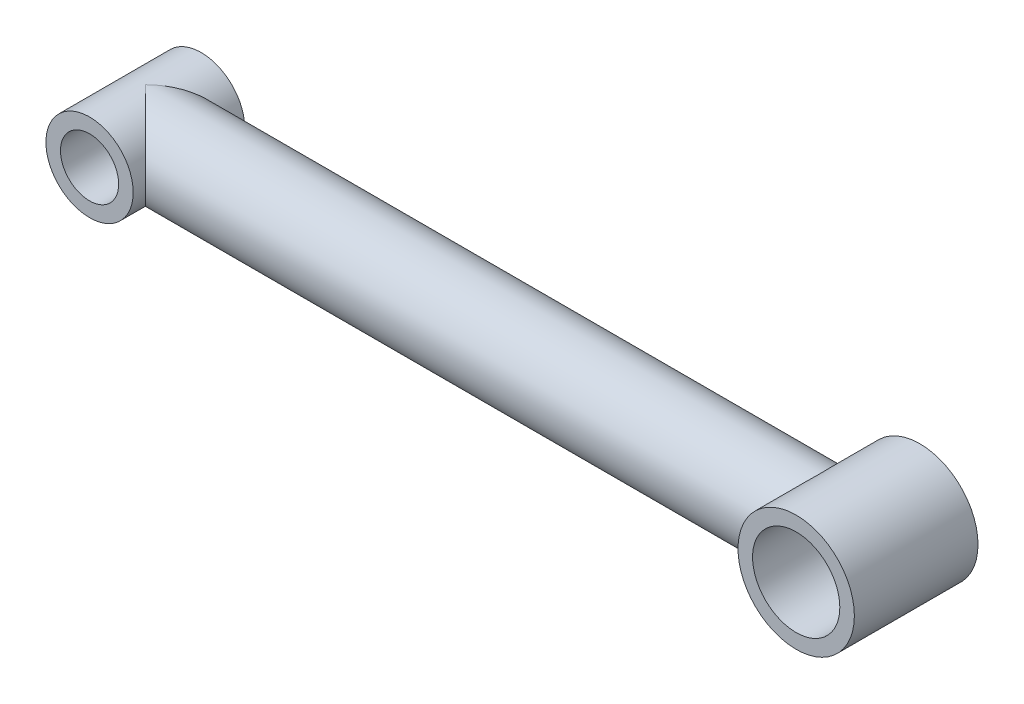
ISO-10303-21;
HEADER;
FILE_DESCRIPTION(('STEP AP214'),'2;1');
FILE_NAME('part.step','',(''),(''),'','','');
FILE_SCHEMA(('AUTOMOTIVE_DESIGN { 1 0 10303 214 1 1 1 1 }'));
ENDSEC;
DATA;
#1=APPLICATION_CONTEXT('core data for automotive mechanical design processes');
#2=APPLICATION_PROTOCOL_DEFINITION('international standard','automotive_design',2000,#1);
#3=PRODUCT_CONTEXT('',#1,'mechanical');
#4=PRODUCT('Part','Part','',(#3));
#5=PRODUCT_RELATED_PRODUCT_CATEGORY('part','',(#4));
#6=PRODUCT_DEFINITION_FORMATION('','',#4);
#7=PRODUCT_DEFINITION_CONTEXT('part definition',#1,'design');
#8=PRODUCT_DEFINITION('design','',#6,#7);
#9=PRODUCT_DEFINITION_SHAPE('','',#8);
#10=(LENGTH_UNIT() NAMED_UNIT(*) SI_UNIT(.MILLI.,.METRE.));
#11=(NAMED_UNIT(*) PLANE_ANGLE_UNIT() SI_UNIT($,.RADIAN.));
#12=(NAMED_UNIT(*) SI_UNIT($,.STERADIAN.) SOLID_ANGLE_UNIT());
#13=UNCERTAINTY_MEASURE_WITH_UNIT(LENGTH_MEASURE(1.E-05),#10,'distance_accuracy_value','');
#14=(GEOMETRIC_REPRESENTATION_CONTEXT(3) GLOBAL_UNCERTAINTY_ASSIGNED_CONTEXT((#13)) GLOBAL_UNIT_ASSIGNED_CONTEXT((#10,
#11,#12)) REPRESENTATION_CONTEXT('',''));
#15=CARTESIAN_POINT('',(0.,0.,0.));
#16=DIRECTION('',(0.,0.,1.));
#17=DIRECTION('',(1.,0.,0.));
#18=AXIS2_PLACEMENT_3D('',#15,#16,#17);
#19=CARTESIAN_POINT('',(-39.51605,0.,0.));
#20=DIRECTION('',(1.,0.,0.));
#21=DIRECTION('',(0.,0.,-1.));
#22=AXIS2_PLACEMENT_3D('',#19,#20,#21);
#23=CYLINDRICAL_SURFACE('',#22,4.8387);
#24=CARTESIAN_POINT('',(33.06445,0.,-4.8387));
#25=CARTESIAN_POINT('',(33.0644511276449,0.118159996354448,-4.83869883155296));
#26=CARTESIAN_POINT('',(33.0677040470359,0.236349582229863,-4.83436390761329));
#27=CARTESIAN_POINT('',(33.0806425925981,0.471795603460159,-4.81709200170503));
#28=CARTESIAN_POINT('',(33.0903320678769,0.589051437938931,-4.80414987255953));
#29=CARTESIAN_POINT('',(33.1159390660575,0.821864655067225,-4.76984545864021));
#30=CARTESIAN_POINT('',(33.1318684564224,0.93741836340248,-4.74846712879409));
#31=CARTESIAN_POINT('',(33.1695970631896,1.16579726358989,-4.69761961613336));
#32=CARTESIAN_POINT('',(33.1913988995626,1.27862121302515,-4.66814682188734));
#33=CARTESIAN_POINT('',(33.2402407572106,1.50004213084022,-4.60175616533791));
#34=CARTESIAN_POINT('',(33.2672453575193,1.60866203273255,-4.56488858149733));
#35=CARTESIAN_POINT('',(33.3260527709962,1.82190326437486,-4.48405016924305));
#36=CARTESIAN_POINT('',(33.357857482271,1.92652299173378,-4.44007653039531));
#37=CARTESIAN_POINT('',(33.4595663516177,2.23349488988543,-4.29828310211814));
#38=CARTESIAN_POINT('',(33.5358311668364,2.42924815891171,-4.19050268829808));
#39=CARTESIAN_POINT('',(33.708015918149,2.81765908109961,-3.94106999342351));
#40=CARTESIAN_POINT('',(33.8051019884369,3.00835138293002,-3.7972053120827));
#41=CARTESIAN_POINT('',(34.0074615553383,3.36460490579047,-3.4854795680493));
#42=CARTESIAN_POINT('',(34.1127475758339,3.53012649818328,-3.31758145764898));
#43=CARTESIAN_POINT('',(34.2823149933385,3.77407784746668,-3.03138797060837));
#44=CARTESIAN_POINT('',(34.3462392295664,3.86095162995898,-2.91994501296414));
#45=CARTESIAN_POINT('',(34.4728843618073,4.02496512794902,-2.68936756979823));
#46=CARTESIAN_POINT('',(34.5356048901483,4.10210190818255,-2.5702307812186));
#47=CARTESIAN_POINT('',(34.6578375009837,4.24615459856921,-2.32453010105055));
#48=CARTESIAN_POINT('',(34.7173527513096,4.31308072464255,-2.197973810679));
#49=CARTESIAN_POINT('',(34.8309303857712,4.43619284285151,-1.93751682307982));
#50=CARTESIAN_POINT('',(34.8849958659324,4.49238494943314,-1.80362036333452));
#51=CARTESIAN_POINT('',(35.0006657616257,4.60902870517622,-1.48551086922291));
#52=CARTESIAN_POINT('',(35.0593666607427,4.66534793469925,-1.29862384274409));
#53=CARTESIAN_POINT('',(35.1316542159518,4.7330018055299,-1.01066267290408));
#54=CARTESIAN_POINT('',(35.1531150810258,4.75274251773177,-0.913460955899135));
#55=CARTESIAN_POINT('',(35.1899870574242,4.78632905185485,-0.716932973596778));
#56=CARTESIAN_POINT('',(35.2054012860945,4.80017791163521,-0.617607830958811));
#57=CARTESIAN_POINT('',(35.2296102673995,4.82180943860323,-0.416525184578084));
#58=CARTESIAN_POINT('',(35.2383409797483,4.82953344307788,-0.314753556219373));
#59=CARTESIAN_POINT('',(35.2485036079525,4.83851600821196,-0.110558761392505));
#60=CARTESIAN_POINT('',(35.2499357240758,4.83977474627331,-0.00813561287877199));
#61=CARTESIAN_POINT('',(35.2454222766859,4.83579274504726,0.196455765710037));
#62=CARTESIAN_POINT('',(35.2394742985726,4.83054987858202,0.298623901389884));
#63=CARTESIAN_POINT('',(35.2205145043996,4.81369606795549,0.501745315341448));
#64=CARTESIAN_POINT('',(35.2075026163712,4.80208505891409,0.602698581225081));
#65=CARTESIAN_POINT('',(35.162245833115,4.76120745183617,0.881127068975693));
#66=CARTESIAN_POINT('',(35.1229204735532,4.72523582699486,1.05651761222448));
#67=CARTESIAN_POINT('',(35.0285085852756,4.63565375404839,1.39823639586973));
#68=CARTESIAN_POINT('',(34.9734069141928,4.5820263521854,1.56455574611924));
#69=CARTESIAN_POINT('',(34.8638066913072,4.47042576454663,1.85687983808639));
#70=CARTESIAN_POINT('',(34.8111151825605,4.41513196729847,1.98461506258768));
#71=CARTESIAN_POINT('',(34.7009489076965,4.29471800382679,2.23327353835713));
#72=CARTESIAN_POINT('',(34.6434716952956,4.22959279813144,2.35419325215968));
#73=CARTESIAN_POINT('',(34.5256223186308,4.08988333951575,2.58932650941927));
#74=CARTESIAN_POINT('',(34.465244392451,4.01527973129272,2.70352561051764));
#75=CARTESIAN_POINT('',(34.3434055101773,3.85705399818053,2.92483404502835));
#76=CARTESIAN_POINT('',(34.2819447251488,3.7734332872758,3.03194448578475));
#77=CARTESIAN_POINT('',(34.1578656967867,3.59514720754391,3.24149981437565));
#78=CARTESIAN_POINT('',(34.0952571190906,3.5002573105847,3.34376013216635));
#79=CARTESIAN_POINT('',(33.9718884854361,3.30138553322304,3.54025943509215));
#80=CARTESIAN_POINT('',(33.9111291703743,3.19740007172284,3.63449523173977));
#81=CARTESIAN_POINT('',(33.7339484449427,2.87246217217889,3.90396839041659));
#82=CARTESIAN_POINT('',(33.6222391886917,2.63799680769806,4.06660007238562));
#83=CARTESIAN_POINT('',(33.44250073536,2.18671053366304,4.32253940065243));
#84=CARTESIAN_POINT('',(33.3702044822965,1.97578128335415,4.42320888615188));
#85=CARTESIAN_POINT('',(33.2770022054627,1.64635976621913,4.55153200521708));
#86=CARTESIAN_POINT('',(33.2484696958296,1.53435050492367,4.59053338154447));
#87=CARTESIAN_POINT('',(33.1970673175814,1.30660047015606,4.66047025763526));
#88=CARTESIAN_POINT('',(33.1741950111743,1.19086132746604,4.69140923009969));
#89=CARTESIAN_POINT('',(33.1344965821523,0.955635674346972,4.74493656739224));
#90=CARTESIAN_POINT('',(33.117710533235,0.836129764303931,4.76746961219771));
#91=CARTESIAN_POINT('',(33.0908021968206,0.59501654901773,4.80352255109813));
#92=CARTESIAN_POINT('',(33.0806799255498,0.473409238658431,4.81704242324615));
#93=CARTESIAN_POINT('',(33.067362553609,0.229180292953863,4.83481950679172));
#94=CARTESIAN_POINT('',(33.0641651429242,0.106559009558504,4.83907980702541));
#95=CARTESIAN_POINT('',(33.0647747076991,-0.138627680293078,4.83826705874601));
#96=CARTESIAN_POINT('',(33.0685811312224,-0.261193090391049,4.83319474568841));
#97=CARTESIAN_POINT('',(33.0823648060857,-0.492857590820958,4.81479110535683));
#98=CARTESIAN_POINT('',(33.0916806613027,-0.60206760610043,4.80234476239973));
#99=CARTESIAN_POINT('',(33.1156917656603,-0.818823991891436,4.77017516914637));
#100=CARTESIAN_POINT('',(33.1303888038885,-0.926369796692505,4.75044949866708));
#101=CARTESIAN_POINT('',(33.1821418059372,-1.24539656535844,4.68073390737616));
#102=CARTESIAN_POINT('',(33.2268712023224,-1.45344963748207,4.62019033146451));
#103=CARTESIAN_POINT('',(33.3354244368606,-1.86266439171962,4.47131800712237));
#104=CARTESIAN_POINT('',(33.3998664553339,-2.06332371281715,4.38208405689383));
#105=CARTESIAN_POINT('',(33.5429339910701,-2.44682113538857,4.18008063536524));
#106=CARTESIAN_POINT('',(33.6215614702782,-2.62965676633063,4.06730790815384));
#107=CARTESIAN_POINT('',(33.8025356563985,-3.00486829701742,3.80069513896698));
#108=CARTESIAN_POINT('',(33.9066506315876,-3.19373829884343,3.64314197270175));
#109=CARTESIAN_POINT('',(34.1212763291417,-3.54426927199526,3.30317541582856));
#110=CARTESIAN_POINT('',(34.2318008931127,-3.70586816976867,3.12070697592009));
#111=CARTESIAN_POINT('',(34.4066417801167,-3.94069404492267,2.81156780143479));
#112=CARTESIAN_POINT('',(34.4715637984172,-4.02322515953912,2.69218557494149));
#113=CARTESIAN_POINT('',(34.59884035061,-4.17782270118707,2.44540965583469));
#114=CARTESIAN_POINT('',(34.6611939351762,-4.24988528334407,2.31801304419834));
#115=CARTESIAN_POINT('',(34.7808419187282,-4.38279911588072,2.05563886364125));
#116=CARTESIAN_POINT('',(34.8381480398632,-4.44367671973697,1.92068011831904));
#117=CARTESIAN_POINT('',(34.9450634119596,-4.55358013314293,1.64322782885859));
#118=CARTESIAN_POINT('',(34.9946790317499,-4.60261576851204,1.50074065189375));
#119=CARTESIAN_POINT('',(35.0928605353592,-4.69725589684139,1.17611323927315));
#120=CARTESIAN_POINT('',(35.1387663235761,-4.73970188420541,0.99217379816162));
#121=CARTESIAN_POINT('',(35.1909251002347,-4.78716754813924,0.710717180417086));
#122=CARTESIAN_POINT('',(35.2055246382197,-4.80028614958089,0.616026650785432));
#123=CARTESIAN_POINT('',(35.2286168899883,-4.82092377247148,0.42531402883707));
#124=CARTESIAN_POINT('',(35.2371123231249,-4.82844528745214,0.329292548910585));
#125=CARTESIAN_POINT('',(35.2476437825593,-4.83775782419048,0.136098108374618));
#126=CARTESIAN_POINT('',(35.2496447975381,-4.83951778593314,0.0389217318341516));
#127=CARTESIAN_POINT('',(35.2469976431341,-4.83718281416198,-0.155267149256333));
#128=CARTESIAN_POINT('',(35.2423496134872,-4.83308800369164,-0.252279657207304));
#129=CARTESIAN_POINT('',(35.2266131434734,-4.81912680919505,-0.445445199963966));
#130=CARTESIAN_POINT('',(35.2155187686437,-4.80925510694057,-0.541597359809289));
#131=CARTESIAN_POINT('',(35.1873663480799,-4.78393105538028,-0.732313948684754));
#132=CARTESIAN_POINT('',(35.1703052159348,-4.76847581775499,-0.826877529411902));
#133=CARTESIAN_POINT('',(35.126594320172,-4.72830663510214,-1.0342034662092));
#134=CARTESIAN_POINT('',(35.098665858096,-4.70230973537356,-1.14644775298811));
#135=CARTESIAN_POINT('',(35.0363121851416,-4.64294527052892,-1.36717108375954));
#136=CARTESIAN_POINT('',(35.0018820738743,-4.60957214258576,-1.47564721414504));
#137=CARTESIAN_POINT('',(34.927844431187,-4.53588394226251,-1.68863845803999));
#138=CARTESIAN_POINT('',(34.888226681287,-4.49555511764852,-1.79314521442501));
#139=CARTESIAN_POINT('',(34.8051581513187,-4.40843102708008,-1.99777835309904));
#140=CARTESIAN_POINT('',(34.7617085406141,-4.36163773142679,-2.09790605787972));
#141=CARTESIAN_POINT('',(34.6565272846475,-4.24456481511026,-2.3277925008318));
#142=CARTESIAN_POINT('',(34.5936859763403,-4.17177165087356,-2.45576861085215));
#143=CARTESIAN_POINT('',(34.4654226977657,-4.01553647003125,-2.70369420017864));
#144=CARTESIAN_POINT('',(34.3999999278143,-3.93209113542169,-2.82364116069386));
#145=CARTESIAN_POINT('',(34.2685206330475,-3.75483227108062,-3.05541312626949));
#146=CARTESIAN_POINT('',(34.2024636678837,-3.66101097708268,-3.16723194397669));
#147=CARTESIAN_POINT('',(34.0715278879066,-3.46329059876146,-3.38230222399991));
#148=CARTESIAN_POINT('',(34.0066489310449,-3.35939273921751,-3.48555472470502));
#149=CARTESIAN_POINT('',(33.8791425335592,-3.14079013524473,-3.68380332411019));
#150=CARTESIAN_POINT('',(33.8165386060585,-3.02600188293851,-3.77872271618356));
#151=CARTESIAN_POINT('',(33.6957506090928,-2.78661626394552,-3.95855981951722));
#152=CARTESIAN_POINT('',(33.6375671178712,-2.66201761827398,-4.04347622306993));
#153=CARTESIAN_POINT('',(33.5273119544545,-2.40371409295216,-4.20215492808913));
#154=CARTESIAN_POINT('',(33.4752287425772,-2.27002718829781,-4.27593836821253));
#155=CARTESIAN_POINT('',(33.3786140715808,-1.99408141538895,-4.41137701708674));
#156=CARTESIAN_POINT('',(33.3340787167316,-1.85182702084044,-4.473038485084));
#157=CARTESIAN_POINT('',(33.2657623321112,-1.60265747736997,-4.5669111388615));
#158=CARTESIAN_POINT('',(33.2397239532616,-1.49760349376278,-4.60245724105523));
#159=CARTESIAN_POINT('',(33.1926268427191,-1.2842826003834,-4.66647907998201));
#160=CARTESIAN_POINT('',(33.1715669019009,-1.17601647795548,-4.69495653357896));
#161=CARTESIAN_POINT('',(33.1348832891105,-0.957151889182371,-4.74441121846435));
#162=CARTESIAN_POINT('',(33.119247051706,-0.84655945201106,-4.76540578896807));
#163=CARTESIAN_POINT('',(33.0936766790807,-0.623573205299409,-4.79967553531581));
#164=CARTESIAN_POINT('',(33.083739627928,-0.511180347239624,-4.81295465873717));
#165=CARTESIAN_POINT('',(33.0726644875589,-0.33215153372516,-4.82774311972536));
#166=CARTESIAN_POINT('',(33.0695868107586,-0.265834926695094,-4.83184914393952));
#167=CARTESIAN_POINT('',(33.0654790847908,-0.133015357179154,-4.83732813291882));
#168=CARTESIAN_POINT('',(33.0644493652477,-0.066512366418997,-4.83870065771988));
#169=CARTESIAN_POINT('',(33.06445,0.,-4.8387));
#170=B_SPLINE_CURVE_WITH_KNOTS('',3,(#24,#25,#26,#27,#28,#29,#30,#31,#32,#33,#34,#35,#36,#37,
#38,#39,#40,#41,#42,#43,#44,#45,#46,#47,#48,#49,#50,#51,#52,#53,#54,#55,#56,#57,#58,#59,#60,#61,
#62,#63,#64,#65,#66,#67,#68,#69,#70,#71,#72,#73,#74,#75,#76,#77,#78,#79,#80,#81,#82,#83,#84,#85,
#86,#87,#88,#89,#90,#91,#92,#93,#94,#95,#96,#97,#98,#99,#100,#101,#102,#103,#104,#105,#106,#107,
#108,#109,#110,#111,#112,#113,#114,#115,#116,#117,#118,#119,#120,#121,#122,#123,#124,#125,#126,
#127,#128,#129,#130,#131,#132,#133,#134,#135,#136,#137,#138,#139,#140,#141,#142,#143,#144,#145,
#146,#147,#148,#149,#150,#151,#152,#153,#154,#155,#156,#157,#158,#159,#160,#161,#162,#163,#164,
#165,#166,#167,#168,#169),.UNSPECIFIED.,.T.,.F.,(4,2,2,2,2,2,2,2,2,2,2,2,2,2,2,2,2,2,2,2,2,2,2,
2,2,2,2,2,2,2,2,2,2,2,2,2,2,2,2,2,2,2,2,2,2,2,2,2,2,2,2,2,2,2,2,2,2,2,2,2,2,2,2,2,2,2,2,2,2,2,2,
2,4),(0.,0.354408201168305,0.709028532051375,1.0643266024824,1.41978345117011,1.77290076532693,
2.12615808019606,2.8317568795631,3.60269699679269,4.37483858436878,4.83968091475279,
5.30466304104262,5.76917685066669,6.23342526390249,6.84238999672531,7.14652863027437,
7.45051025830039,7.757369338215,8.06421999810821,8.37117107908519,8.67812528740899,
9.2258305101415,9.77406320199427,10.2199690584008,10.6661042622511,11.1131655940228,
11.5601569231506,12.0183670232097,12.4767583484641,13.3908461510661,14.1216138028407,
14.4871877614962,14.8526039960592,15.2203843257566,15.5881655509903,15.9558240718032,
16.323453620571,16.6539889705622,16.9846343139306,17.6453805141716,18.3294462201622,
19.0136066097052,19.8120220484946,20.6122309933505,21.0887279857429,21.565399545503,
22.0409331751716,22.51607086675,23.0963137569982,23.3861206474247,23.6757983499205,
23.9670351293571,24.2582657882714,24.5497649779372,24.8414151742895,25.1965355669424,
25.5519246951956,25.9080246976216,26.2640164030779,26.7436115016327,27.2233563536275,
27.7034626562967,28.183510676302,28.6675943356342,29.151741209971,29.6349569208154,
30.1179224614235,30.4593472560299,30.8006890425849,31.1412346549859,31.4816058748157,
31.681070462835,31.8805671526224),.UNSPECIFIED.);
#171=CARTESIAN_POINT('',(33.06445,0.,-4.8387));
#172=VERTEX_POINT('',#171);
#173=EDGE_CURVE('E11',#172,#172,#170,.T.);
#174=ORIENTED_EDGE('',*,*,#173,.F.);
#175=EDGE_LOOP('',(#174));
#176=FACE_BOUND('',#175,.T.);
#177=CARTESIAN_POINT('',(-39.51605,0.,0.));
#178=DIRECTION('',(0.707106781186547,0.,0.707106781186547));
#179=DIRECTION('',(0.707106781186547,0.,-0.707106781186547));
#180=AXIS2_PLACEMENT_3D('',#177,#178,#179);
#181=ELLIPSE('',#180,6.84295516425469,4.8387);
#182=CARTESIAN_POINT('',(-39.51605,4.8387,0.));
#183=VERTEX_POINT('',#182);
#184=CARTESIAN_POINT('',(-39.51605,-4.8387,0.));
#185=VERTEX_POINT('',#184);
#186=EDGE_CURVE('E44',#183,#185,#181,.F.);
#187=ORIENTED_EDGE('',*,*,#186,.F.);
#188=CARTESIAN_POINT('',(-39.51605,0.,0.));
#189=DIRECTION('',(0.707106781186547,0.,-0.707106781186547));
#190=DIRECTION('',(0.707106781186547,0.,0.707106781186547));
#191=AXIS2_PLACEMENT_3D('',#188,#189,#190);
#192=ELLIPSE('',#191,6.84295516425469,4.8387);
#193=EDGE_CURVE('E50',#185,#183,#192,.F.);
#194=ORIENTED_EDGE('',*,*,#193,.F.);
#195=EDGE_LOOP('',(#187,#194));
#196=FACE_BOUND('',#195,.T.);
#197=ADVANCED_FACE('F32',(#176,#196),#23,.T.);
#198=CARTESIAN_POINT('',(-39.51605,0.,-6.18871));
#199=DIRECTION('',(0.,0.,1.));
#200=DIRECTION('',(1.,0.,0.));
#201=AXIS2_PLACEMENT_3D('',#198,#199,#200);
#202=CYLINDRICAL_SURFACE('',#201,4.8387);
#203=ORIENTED_EDGE('',*,*,#193,.T.);
#204=ORIENTED_EDGE('',*,*,#186,.T.);
#205=EDGE_LOOP('',(#203,#204));
#206=FACE_BOUND('',#205,.T.);
#207=CARTESIAN_POINT('',(-39.51605,0.,-6.18871));
#208=DIRECTION('',(0.,0.,1.));
#209=DIRECTION('',(1.,0.,0.));
#210=AXIS2_PLACEMENT_3D('',#207,#208,#209);
#211=CIRCLE('',#210,4.8387);
#212=CARTESIAN_POINT('',(-34.67735,0.,-6.18871));
#213=VERTEX_POINT('',#212);
#214=EDGE_CURVE('E55',#213,#213,#211,.T.);
#215=ORIENTED_EDGE('',*,*,#214,.T.);
#216=EDGE_LOOP('',(#215));
#217=FACE_BOUND('',#216,.T.);
#218=CARTESIAN_POINT('',(-39.51605,0.,6.18871));
#219=DIRECTION('',(0.,0.,1.));
#220=DIRECTION('',(1.,0.,0.));
#221=AXIS2_PLACEMENT_3D('',#218,#219,#220);
#222=CIRCLE('',#221,4.8387);
#223=CARTESIAN_POINT('',(-34.67735,0.,6.18871));
#224=VERTEX_POINT('',#223);
#225=EDGE_CURVE('E58',#224,#224,#222,.T.);
#226=ORIENTED_EDGE('',*,*,#225,.F.);
#227=EDGE_LOOP('',(#226));
#228=FACE_BOUND('',#227,.T.);
#229=ADVANCED_FACE('F53',(#206,#217,#228),#202,.T.);
#230=CARTESIAN_POINT('',(-39.51605,0.,-6.18871));
#231=DIRECTION('',(0.,0.,1.));
#232=DIRECTION('',(1.,0.,0.));
#233=AXIS2_PLACEMENT_3D('',#230,#231,#232);
#234=PLANE('',#233);
#235=CARTESIAN_POINT('',(-39.51605,0.,-6.18871));
#236=DIRECTION('',(0.,0.,1.));
#237=DIRECTION('',(1.,0.,0.));
#238=AXIS2_PLACEMENT_3D('',#235,#236,#237);
#239=CIRCLE('',#238,3.2258);
#240=CARTESIAN_POINT('',(-36.29025,0.,-6.18871));
#241=VERTEX_POINT('',#240);
#242=EDGE_CURVE('E63',#241,#241,#239,.T.);
#243=ORIENTED_EDGE('',*,*,#242,.T.);
#244=EDGE_LOOP('',(#243));
#245=FACE_BOUND('',#244,.T.);
#246=ORIENTED_EDGE('',*,*,#214,.F.);
#247=EDGE_LOOP('',(#246));
#248=FACE_BOUND('',#247,.T.);
#249=ADVANCED_FACE('F116',(#245,#248),#234,.F.);
#250=CARTESIAN_POINT('',(-39.51605,0.,6.18871));
#251=DIRECTION('',(0.,0.,1.));
#252=DIRECTION('',(1.,0.,0.));
#253=AXIS2_PLACEMENT_3D('',#250,#251,#252);
#254=PLANE('',#253);
#255=CARTESIAN_POINT('',(-39.51605,0.,6.18871));
#256=DIRECTION('',(0.,0.,1.));
#257=DIRECTION('',(1.,0.,0.));
#258=AXIS2_PLACEMENT_3D('',#255,#256,#257);
#259=CIRCLE('',#258,3.2258);
#260=CARTESIAN_POINT('',(-36.29025,0.,6.18871));
#261=VERTEX_POINT('',#260);
#262=EDGE_CURVE('E64',#261,#261,#259,.T.);
#263=ORIENTED_EDGE('',*,*,#262,.F.);
#264=EDGE_LOOP('',(#263));
#265=FACE_BOUND('',#264,.T.);
#266=ORIENTED_EDGE('',*,*,#225,.T.);
#267=EDGE_LOOP('',(#266));
#268=FACE_BOUND('',#267,.T.);
#269=ADVANCED_FACE('F106',(#265,#268),#254,.T.);
#270=CARTESIAN_POINT('',(-39.51605,0.,-6.18871));
#271=DIRECTION('',(0.,0.,1.));
#272=DIRECTION('',(1.,0.,0.));
#273=AXIS2_PLACEMENT_3D('',#270,#271,#272);
#274=CYLINDRICAL_SURFACE('',#273,3.2258);
#275=ORIENTED_EDGE('',*,*,#242,.F.);
#276=EDGE_LOOP('',(#275));
#277=FACE_BOUND('',#276,.T.);
#278=ORIENTED_EDGE('',*,*,#262,.T.);
#279=EDGE_LOOP('',(#278));
#280=FACE_BOUND('',#279,.T.);
#281=ADVANCED_FACE('F99',(#277,#280),#274,.F.);
#282=CARTESIAN_POINT('',(39.51605,0.,-6.85546));
#283=DIRECTION('',(0.,0.,1.));
#284=DIRECTION('',(1.,0.,0.));
#285=AXIS2_PLACEMENT_3D('',#282,#283,#284);
#286=CYLINDRICAL_SURFACE('',#285,6.4516);
#287=ORIENTED_EDGE('',*,*,#173,.T.);
#288=EDGE_LOOP('',(#287));
#289=FACE_BOUND('',#288,.T.);
#290=CARTESIAN_POINT('',(39.51605,0.,-6.85546));
#291=DIRECTION('',(0.,0.,1.));
#292=DIRECTION('',(1.,0.,0.));
#293=AXIS2_PLACEMENT_3D('',#290,#291,#292);
#294=CIRCLE('',#293,6.4516);
#295=CARTESIAN_POINT('',(45.96765,0.,-6.85546));
#296=VERTEX_POINT('',#295);
#297=EDGE_CURVE('E67',#296,#296,#294,.T.);
#298=ORIENTED_EDGE('',*,*,#297,.T.);
#299=EDGE_LOOP('',(#298));
#300=FACE_BOUND('',#299,.T.);
#301=CARTESIAN_POINT('',(39.51605,0.,6.85546));
#302=DIRECTION('',(0.,0.,1.));
#303=DIRECTION('',(1.,0.,0.));
#304=AXIS2_PLACEMENT_3D('',#301,#302,#303);
#305=CIRCLE('',#304,6.4516);
#306=CARTESIAN_POINT('',(45.96765,0.,6.85546));
#307=VERTEX_POINT('',#306);
#308=EDGE_CURVE('E72',#307,#307,#305,.T.);
#309=ORIENTED_EDGE('',*,*,#308,.F.);
#310=EDGE_LOOP('',(#309));
#311=FACE_BOUND('',#310,.T.);
#312=ADVANCED_FACE('F97',(#289,#300,#311),#286,.T.);
#313=CARTESIAN_POINT('',(39.51605,0.,-6.85546));
#314=DIRECTION('',(0.,0.,1.));
#315=DIRECTION('',(1.,0.,0.));
#316=AXIS2_PLACEMENT_3D('',#313,#314,#315);
#317=PLANE('',#316);
#318=CARTESIAN_POINT('',(39.51605,0.,-6.85546));
#319=DIRECTION('',(0.,0.,1.));
#320=DIRECTION('',(1.,0.,0.));
#321=AXIS2_PLACEMENT_3D('',#318,#319,#320);
#322=CIRCLE('',#321,4.8387);
#323=CARTESIAN_POINT('',(44.35475,0.,-6.85546));
#324=VERTEX_POINT('',#323);
#325=EDGE_CURVE('E75',#324,#324,#322,.T.);
#326=ORIENTED_EDGE('',*,*,#325,.T.);
#327=EDGE_LOOP('',(#326));
#328=FACE_BOUND('',#327,.T.);
#329=ORIENTED_EDGE('',*,*,#297,.F.);
#330=EDGE_LOOP('',(#329));
#331=FACE_BOUND('',#330,.T.);
#332=ADVANCED_FACE('F82',(#328,#331),#317,.F.);
#333=CARTESIAN_POINT('',(39.51605,0.,6.85546));
#334=DIRECTION('',(0.,0.,1.));
#335=DIRECTION('',(1.,0.,0.));
#336=AXIS2_PLACEMENT_3D('',#333,#334,#335);
#337=PLANE('',#336);
#338=CARTESIAN_POINT('',(39.51605,0.,6.85546));
#339=DIRECTION('',(0.,0.,1.));
#340=DIRECTION('',(1.,0.,0.));
#341=AXIS2_PLACEMENT_3D('',#338,#339,#340);
#342=CIRCLE('',#341,4.8387);
#343=CARTESIAN_POINT('',(44.35475,0.,6.85546));
#344=VERTEX_POINT('',#343);
#345=EDGE_CURVE('E76',#344,#344,#342,.T.);
#346=ORIENTED_EDGE('',*,*,#345,.F.);
#347=EDGE_LOOP('',(#346));
#348=FACE_BOUND('',#347,.T.);
#349=ORIENTED_EDGE('',*,*,#308,.T.);
#350=EDGE_LOOP('',(#349));
#351=FACE_BOUND('',#350,.T.);
#352=ADVANCED_FACE('F88',(#348,#351),#337,.T.);
#353=CARTESIAN_POINT('',(39.51605,0.,-6.85546));
#354=DIRECTION('',(0.,0.,1.));
#355=DIRECTION('',(1.,0.,0.));
#356=AXIS2_PLACEMENT_3D('',#353,#354,#355);
#357=CYLINDRICAL_SURFACE('',#356,4.8387);
#358=ORIENTED_EDGE('',*,*,#325,.F.);
#359=EDGE_LOOP('',(#358));
#360=FACE_BOUND('',#359,.T.);
#361=ORIENTED_EDGE('',*,*,#345,.T.);
#362=EDGE_LOOP('',(#361));
#363=FACE_BOUND('',#362,.T.);
#364=ADVANCED_FACE('F85',(#360,#363),#357,.F.);
#365=CLOSED_SHELL('',(#197,#229,#249,#269,#281,#312,#332,#352,#364));
#366=MANIFOLD_SOLID_BREP('B2',#365);
#367=ADVANCED_BREP_SHAPE_REPRESENTATION('',(#18,#366),#14);
#368=SHAPE_DEFINITION_REPRESENTATION(#9,#367);
ENDSEC;
END-ISO-10303-21;
